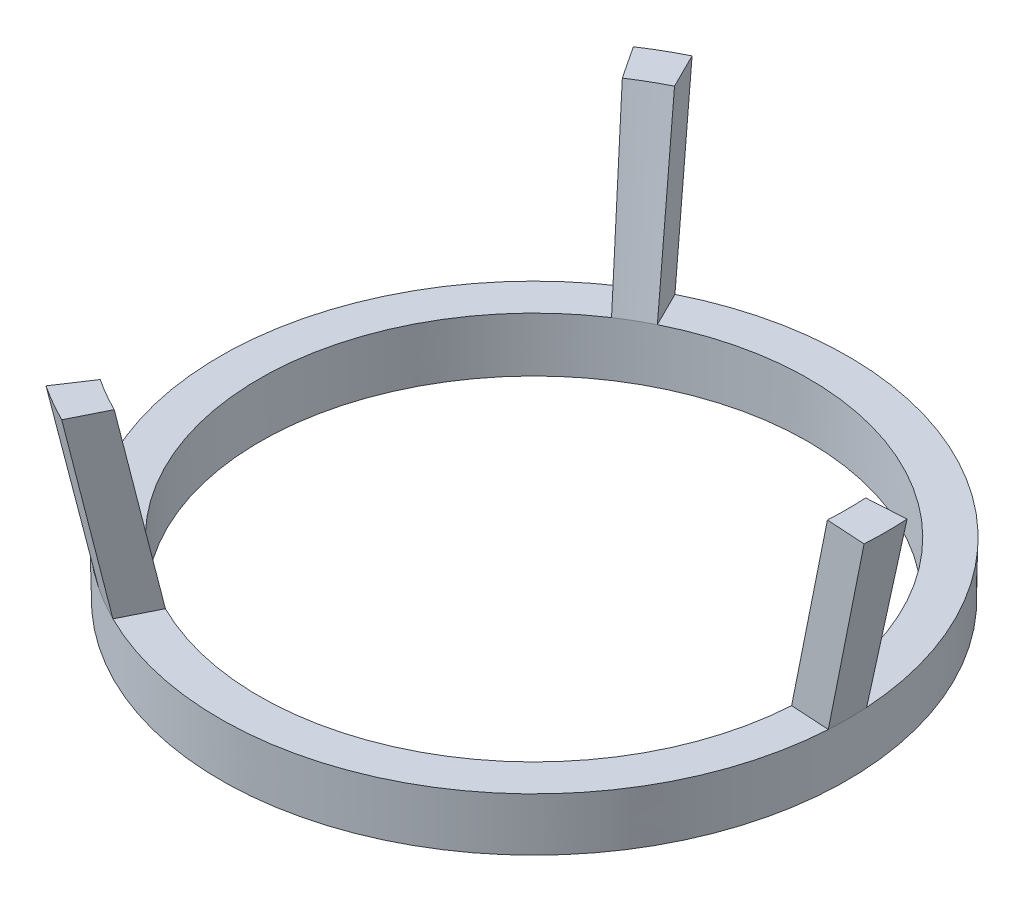
ISO-10303-21;
HEADER;
FILE_DESCRIPTION(('STEP AP214'),'2;1');
FILE_NAME('part.step','',(''),(''),'','','');
FILE_SCHEMA(('AUTOMOTIVE_DESIGN { 1 0 10303 214 1 1 1 1 }'));
ENDSEC;
DATA;
#1=APPLICATION_CONTEXT('core data for automotive mechanical design processes');
#2=APPLICATION_PROTOCOL_DEFINITION('international standard','automotive_design',2000,#1);
#3=PRODUCT_CONTEXT('',#1,'mechanical');
#4=PRODUCT('Part','Part','',(#3));
#5=PRODUCT_RELATED_PRODUCT_CATEGORY('part','',(#4));
#6=PRODUCT_DEFINITION_FORMATION('','',#4);
#7=PRODUCT_DEFINITION_CONTEXT('part definition',#1,'design');
#8=PRODUCT_DEFINITION('design','',#6,#7);
#9=PRODUCT_DEFINITION_SHAPE('','',#8);
#10=(LENGTH_UNIT() NAMED_UNIT(*) SI_UNIT(.MILLI.,.METRE.));
#11=(NAMED_UNIT(*) PLANE_ANGLE_UNIT() SI_UNIT($,.RADIAN.));
#12=(NAMED_UNIT(*) SI_UNIT($,.STERADIAN.) SOLID_ANGLE_UNIT());
#13=UNCERTAINTY_MEASURE_WITH_UNIT(LENGTH_MEASURE(1.E-05),#10,'distance_accuracy_value','');
#14=(GEOMETRIC_REPRESENTATION_CONTEXT(3) GLOBAL_UNCERTAINTY_ASSIGNED_CONTEXT((#13)) GLOBAL_UNIT_ASSIGNED_CONTEXT((#10,
#11,#12)) REPRESENTATION_CONTEXT('',''));
#15=CARTESIAN_POINT('',(0.,0.,0.));
#16=DIRECTION('',(0.,0.,1.));
#17=DIRECTION('',(1.,0.,0.));
#18=AXIS2_PLACEMENT_3D('',#15,#16,#17);
#19=CARTESIAN_POINT('',(14.0497844827586,2.75,0.));
#20=DIRECTION('',(0.,1.,0.));
#21=DIRECTION('',(0.,0.,1.));
#22=AXIS2_PLACEMENT_3D('',#19,#20,#21);
#23=PLANE('',#22);
#24=CARTESIAN_POINT('',(0.,2.75,0.));
#25=DIRECTION('',(0.,-1.,0.));
#26=DIRECTION('',(0.,0.,-1.));
#27=AXIS2_PLACEMENT_3D('',#24,#25,#26);
#28=CIRCLE('',#27,16.0497844827586);
#29=CARTESIAN_POINT('',(-7.16137873709051,2.75,-14.3635036299277));
#30=VERTEX_POINT('',#29);
#31=CARTESIAN_POINT('',(16.0198483994127,2.75,-0.979815902521624));
#32=VERTEX_POINT('',#31);
#33=EDGE_CURVE('E223',#30,#32,#28,.T.);
#34=ORIENTED_EDGE('',*,*,#33,.F.);
#35=DIRECTION('',(-0.4461978131098,0.,-0.894934361602029));
#36=VECTOR('',#35,1.);
#37=CARTESIAN_POINT('',(-7.16137873709051,2.75,-14.3635036299277));
#38=LINE('',#37,#36);
#39=CARTESIAN_POINT('',(-6.26898311087091,2.75,-12.5736349067237));
#40=VERTEX_POINT('',#39);
#41=EDGE_CURVE('E50',#40,#30,#38,.T.);
#42=ORIENTED_EDGE('',*,*,#41,.F.);
#43=CARTESIAN_POINT('',(0.,2.75,0.));
#44=DIRECTION('',(0.,-1.,0.));
#45=DIRECTION('',(0.,0.,-1.));
#46=AXIS2_PLACEMENT_3D('',#43,#44,#45);
#47=CIRCLE('',#46,14.0497844827586);
#48=CARTESIAN_POINT('',(14.023578802569,2.75,-0.85771882345191));
#49=VERTEX_POINT('',#48);
#50=EDGE_CURVE('E225',#40,#49,#47,.T.);
#51=ORIENTED_EDGE('',*,*,#50,.T.);
#52=DIRECTION('',(0.998134798421867,0.,-0.061048539534857));
#53=VECTOR('',#52,1.);
#54=CARTESIAN_POINT('',(16.0198483994127,2.75,-0.979815902521624));
#55=LINE('',#54,#53);
#56=EDGE_CURVE('E204',#49,#32,#55,.T.);
#57=ORIENTED_EDGE('',*,*,#56,.T.);
#58=EDGE_LOOP('',(#34,#42,#51,#57));
#59=FACE_BOUND('',#58,.T.);
#60=ADVANCED_FACE('F35',(#59),#23,.T.);
#61=DIRECTION('',(-0.551936985312051,0.,-0.833885822067173));
#62=VECTOR('',#61,1.);
#63=CARTESIAN_POINT('',(-8.85846966232192,2.75,-13.3836877274061));
#64=LINE('',#63,#62);
#65=CARTESIAN_POINT('',(-7.75459569169782,2.75,-11.7159160832718));
#66=VERTEX_POINT('',#65);
#67=CARTESIAN_POINT('',(-8.85846966232192,2.75,-13.3836877274061));
#68=VERTEX_POINT('',#67);
#69=EDGE_CURVE('E148',#66,#68,#64,.T.);
#70=ORIENTED_EDGE('',*,*,#69,.T.);
#71=CARTESIAN_POINT('',(-8.85846966232211,2.75,13.383687727406));
#72=VERTEX_POINT('',#71);
#73=EDGE_CURVE('E254',#72,#68,#28,.T.);
#74=ORIENTED_EDGE('',*,*,#73,.F.);
#75=DIRECTION('',(-0.551936985312062,0.,0.833885822067166));
#76=VECTOR('',#75,1.);
#77=CARTESIAN_POINT('',(-8.85846966232211,2.75,13.383687727406));
#78=LINE('',#77,#76);
#79=CARTESIAN_POINT('',(-7.75459569169799,2.75,11.7159160832717));
#80=VERTEX_POINT('',#79);
#81=EDGE_CURVE('E58',#80,#72,#78,.T.);
#82=ORIENTED_EDGE('',*,*,#81,.F.);
#83=EDGE_CURVE('E233',#80,#66,#47,.T.);
#84=ORIENTED_EDGE('',*,*,#83,.T.);
#85=EDGE_LOOP('',(#70,#74,#82,#84));
#86=FACE_BOUND('',#85,.T.);
#87=ADVANCED_FACE('F239',(#86),#23,.T.);
#88=DIRECTION('',(-0.446197813109813,0.,0.894934361602023));
#89=VECTOR('',#88,1.);
#90=CARTESIAN_POINT('',(-7.16137873709071,2.75,14.3635036299276));
#91=LINE('',#90,#89);
#92=CARTESIAN_POINT('',(-6.26898311087108,2.75,12.5736349067236));
#93=VERTEX_POINT('',#92);
#94=CARTESIAN_POINT('',(-7.16137873709071,2.75,14.3635036299276));
#95=VERTEX_POINT('',#94);
#96=EDGE_CURVE('E172',#93,#95,#91,.T.);
#97=ORIENTED_EDGE('',*,*,#96,.T.);
#98=CARTESIAN_POINT('',(16.0198483994127,2.75,0.979815902521624));
#99=VERTEX_POINT('',#98);
#100=EDGE_CURVE('E226',#99,#95,#28,.T.);
#101=ORIENTED_EDGE('',*,*,#100,.F.);
#102=DIRECTION('',(0.998134798421867,0.,0.061048539534857));
#103=VECTOR('',#102,1.);
#104=CARTESIAN_POINT('',(16.0198483994127,2.75,0.979815902521624));
#105=LINE('',#104,#103);
#106=CARTESIAN_POINT('',(14.023578802569,2.75,0.85771882345191));
#107=VERTEX_POINT('',#106);
#108=EDGE_CURVE('E192',#107,#99,#105,.T.);
#109=ORIENTED_EDGE('',*,*,#108,.F.);
#110=EDGE_CURVE('E228',#107,#93,#47,.T.);
#111=ORIENTED_EDGE('',*,*,#110,.T.);
#112=EDGE_LOOP('',(#97,#101,#109,#111));
#113=FACE_BOUND('',#112,.T.);
#114=ADVANCED_FACE('F269',(#113),#23,.T.);
#115=CARTESIAN_POINT('',(16.,0.,0.));
#116=DIRECTION('',(0.,-1.,0.));
#117=DIRECTION('',(0.,0.,-1.));
#118=AXIS2_PLACEMENT_3D('',#115,#116,#117);
#119=PLANE('',#118);
#120=CARTESIAN_POINT('',(0.,0.,0.));
#121=DIRECTION('',(0.,-1.,0.));
#122=DIRECTION('',(0.,0.,-1.));
#123=AXIS2_PLACEMENT_3D('',#120,#121,#122);
#124=CIRCLE('',#123,16.);
#125=CARTESIAN_POINT('',(0.,0.,-16.));
#126=VERTEX_POINT('',#125);
#127=EDGE_CURVE('E220',#126,#126,#124,.T.);
#128=ORIENTED_EDGE('',*,*,#127,.T.);
#129=EDGE_LOOP('',(#128));
#130=FACE_BOUND('',#129,.T.);
#131=CARTESIAN_POINT('',(0.,0.,0.));
#132=DIRECTION('',(0.,-1.,0.));
#133=DIRECTION('',(0.,0.,-1.));
#134=AXIS2_PLACEMENT_3D('',#131,#132,#133);
#135=CIRCLE('',#134,14.);
#136=CARTESIAN_POINT('',(0.,0.,-14.));
#137=VERTEX_POINT('',#136);
#138=EDGE_CURVE('E11',#137,#137,#135,.T.);
#139=ORIENTED_EDGE('',*,*,#138,.F.);
#140=EDGE_LOOP('',(#139));
#141=FACE_BOUND('',#140,.T.);
#142=ADVANCED_FACE('F37',(#130,#141),#119,.T.);
#143=CARTESIAN_POINT('',(0.,2.75,0.));
#144=DIRECTION('',(0.,1.,0.));
#145=DIRECTION('',(0.,0.,1.));
#146=AXIS2_PLACEMENT_3D('',#143,#144,#145);
#147=CONICAL_SURFACE('',#146,14.0497844827586,0.0181014709544314);
#148=ORIENTED_EDGE('',*,*,#138,.T.);
#149=EDGE_LOOP('',(#148));
#150=FACE_BOUND('',#149,.T.);
#151=EDGE_CURVE('E43',#49,#107,#47,.T.);
#152=ORIENTED_EDGE('',*,*,#151,.F.);
#153=ORIENTED_EDGE('',*,*,#50,.F.);
#154=CARTESIAN_POINT('',(0.,2.75,0.));
#155=DIRECTION('',(0.,-1.,0.));
#156=DIRECTION('',(-0.866025403784443,0.,0.499999999999992));
#157=AXIS2_PLACEMENT_3D('',#154,#155,#156);
#158=CIRCLE('',#157,14.0497844827586);
#159=EDGE_CURVE('E162',#66,#40,#158,.T.);
#160=ORIENTED_EDGE('',*,*,#159,.F.);
#161=ORIENTED_EDGE('',*,*,#83,.F.);
#162=CARTESIAN_POINT('',(0.,2.75,0.));
#163=DIRECTION('',(0.,-1.,0.));
#164=DIRECTION('',(0.866025403784436,0.,0.500000000000004));
#165=AXIS2_PLACEMENT_3D('',#162,#163,#164);
#166=CIRCLE('',#165,14.0497844827586);
#167=EDGE_CURVE('E190',#93,#80,#166,.T.);
#168=ORIENTED_EDGE('',*,*,#167,.F.);
#169=ORIENTED_EDGE('',*,*,#110,.F.);
#170=EDGE_LOOP('',(#152,#153,#160,#161,#168,#169));
#171=FACE_BOUND('',#170,.T.);
#172=ADVANCED_FACE('F246',(#150,#171),#147,.F.);
#173=CARTESIAN_POINT('',(0.,0.,0.));
#174=DIRECTION('',(0.,1.,0.));
#175=DIRECTION('',(0.,0.,1.));
#176=AXIS2_PLACEMENT_3D('',#173,#174,#175);
#177=CONICAL_SURFACE('',#176,16.,0.018101470954432);
#178=EDGE_CURVE('E224',#32,#99,#28,.T.);
#179=ORIENTED_EDGE('',*,*,#178,.T.);
#180=ORIENTED_EDGE('',*,*,#100,.T.);
#181=CARTESIAN_POINT('',(0.,2.75,0.));
#182=DIRECTION('',(0.,-1.,0.));
#183=DIRECTION('',(0.866025403784436,0.,0.500000000000004));
#184=AXIS2_PLACEMENT_3D('',#181,#182,#183);
#185=CIRCLE('',#184,16.0497844827586);
#186=EDGE_CURVE('E183',#95,#72,#185,.T.);
#187=ORIENTED_EDGE('',*,*,#186,.T.);
#188=ORIENTED_EDGE('',*,*,#73,.T.);
#189=CARTESIAN_POINT('',(0.,2.75,0.));
#190=DIRECTION('',(0.,-1.,0.));
#191=DIRECTION('',(-0.866025403784443,0.,0.499999999999992));
#192=AXIS2_PLACEMENT_3D('',#189,#190,#191);
#193=CIRCLE('',#192,16.0497844827586);
#194=EDGE_CURVE('E138',#68,#30,#193,.T.);
#195=ORIENTED_EDGE('',*,*,#194,.T.);
#196=ORIENTED_EDGE('',*,*,#33,.T.);
#197=EDGE_LOOP('',(#179,#180,#187,#188,#195,#196));
#198=FACE_BOUND('',#197,.T.);
#199=ORIENTED_EDGE('',*,*,#127,.F.);
#200=EDGE_LOOP('',(#199));
#201=FACE_BOUND('',#200,.T.);
#202=ADVANCED_FACE('F255',(#198,#201),#177,.T.);
#203=CARTESIAN_POINT('',(0.,12.,0.));
#204=DIRECTION('',(0.,1.,0.));
#205=DIRECTION('',(0.,0.,1.));
#206=AXIS2_PLACEMENT_3D('',#203,#204,#205);
#207=CONICAL_SURFACE('',#206,16.,0.2077909394396);
#208=CARTESIAN_POINT('',(0.,12.,0.));
#209=DIRECTION('',(0.,-1.,0.));
#210=DIRECTION('',(0.,0.,-1.));
#211=AXIS2_PLACEMENT_3D('',#208,#209,#210);
#212=CIRCLE('',#211,16.);
#213=CARTESIAN_POINT('',(15.9701567747499,12.,-0.976776632557712));
#214=VERTEX_POINT('',#213);
#215=CARTESIAN_POINT('',(15.9701567747499,12.,0.976776632557712));
#216=VERTEX_POINT('',#215);
#217=EDGE_CURVE('E218',#214,#216,#212,.T.);
#218=ORIENTED_EDGE('',*,*,#217,.F.);
#219=DIRECTION('',(-0.205914074480488,-0.978489028523481,0.0125942443210886));
#220=VECTOR('',#219,1.);
#221=CARTESIAN_POINT('',(14.023578802569,2.75,-0.85771882345191));
#222=LINE('',#221,#220);
#223=EDGE_CURVE('E213',#214,#49,#222,.T.);
#224=ORIENTED_EDGE('',*,*,#223,.T.);
#225=ORIENTED_EDGE('',*,*,#151,.T.);
#226=DIRECTION('',(-0.205914074480488,-0.978489028523481,-0.0125942443210886));
#227=VECTOR('',#226,1.);
#228=CARTESIAN_POINT('',(14.023578802569,2.75,0.85771882345191));
#229=LINE('',#228,#227);
#230=EDGE_CURVE('E201',#216,#107,#229,.T.);
#231=ORIENTED_EDGE('',*,*,#230,.F.);
#232=EDGE_LOOP('',(#218,#224,#225,#231));
#233=FACE_BOUND('',#232,.T.);
#234=ADVANCED_FACE('F299',(#233),#207,.F.);
#235=CARTESIAN_POINT('',(15.9701567747499,12.,-0.976776632557712));
#236=DIRECTION('',(0.,1.,0.));
#237=DIRECTION('',(0.,0.,1.));
#238=AXIS2_PLACEMENT_3D('',#235,#236,#237);
#239=PLANE('',#238);
#240=CARTESIAN_POINT('',(0.,12.,0.));
#241=DIRECTION('',(0.,-1.,0.));
#242=DIRECTION('',(0.,0.,-1.));
#243=AXIS2_PLACEMENT_3D('',#240,#241,#242);
#244=CIRCLE('',#243,18.);
#245=CARTESIAN_POINT('',(17.9664263715936,12.,-1.09887371162743));
#246=VERTEX_POINT('',#245);
#247=CARTESIAN_POINT('',(17.9664263715936,12.,1.09887371162743));
#248=VERTEX_POINT('',#247);
#249=EDGE_CURVE('E216',#246,#248,#244,.T.);
#250=ORIENTED_EDGE('',*,*,#249,.F.);
#251=DIRECTION('',(-0.998134798421867,0.,0.061048539534857));
#252=VECTOR('',#251,1.);
#253=CARTESIAN_POINT('',(15.9701567747499,12.,-0.976776632557712));
#254=LINE('',#253,#252);
#255=EDGE_CURVE('E210',#246,#214,#254,.T.);
#256=ORIENTED_EDGE('',*,*,#255,.T.);
#257=ORIENTED_EDGE('',*,*,#217,.T.);
#258=DIRECTION('',(-0.998134798421867,0.,-0.061048539534857));
#259=VECTOR('',#258,1.);
#260=CARTESIAN_POINT('',(15.9701567747499,12.,0.976776632557712));
#261=LINE('',#260,#259);
#262=EDGE_CURVE('E198',#248,#216,#261,.T.);
#263=ORIENTED_EDGE('',*,*,#262,.F.);
#264=EDGE_LOOP('',(#250,#256,#257,#263));
#265=FACE_BOUND('',#264,.T.);
#266=ADVANCED_FACE('F295',(#265),#239,.T.);
#267=CARTESIAN_POINT('',(0.,2.75,0.));
#268=DIRECTION('',(0.,1.,0.));
#269=DIRECTION('',(0.,0.,1.));
#270=AXIS2_PLACEMENT_3D('',#267,#268,#269);
#271=CONICAL_SURFACE('',#270,16.0497844827586,0.2077909394396);
#272=DIRECTION('',(0.205914074480488,0.978489028523481,-0.0125942443210886));
#273=VECTOR('',#272,1.);
#274=CARTESIAN_POINT('',(17.9664263715936,12.,-1.09887371162743));
#275=LINE('',#274,#273);
#276=EDGE_CURVE('E207',#32,#246,#275,.T.);
#277=ORIENTED_EDGE('',*,*,#276,.T.);
#278=ORIENTED_EDGE('',*,*,#249,.T.);
#279=DIRECTION('',(0.205914074480488,0.978489028523481,0.0125942443210886));
#280=VECTOR('',#279,1.);
#281=CARTESIAN_POINT('',(17.9664263715936,12.,1.09887371162743));
#282=LINE('',#281,#280);
#283=EDGE_CURVE('E195',#99,#248,#282,.T.);
#284=ORIENTED_EDGE('',*,*,#283,.F.);
#285=ORIENTED_EDGE('',*,*,#178,.F.);
#286=EDGE_LOOP('',(#277,#278,#284,#285));
#287=FACE_BOUND('',#286,.T.);
#288=ADVANCED_FACE('F289',(#287),#271,.T.);
#289=CARTESIAN_POINT('',(0.,0.,0.));
#290=DIRECTION('',(-0.061048539534857,0.,-0.998134798421867));
#291=DIRECTION('',(-0.998134798421867,0.,0.061048539534857));
#292=AXIS2_PLACEMENT_3D('',#289,#290,#291);
#293=PLANE('',#292);
#294=ORIENTED_EDGE('',*,*,#56,.F.);
#295=ORIENTED_EDGE('',*,*,#223,.F.);
#296=ORIENTED_EDGE('',*,*,#255,.F.);
#297=ORIENTED_EDGE('',*,*,#276,.F.);
#298=EDGE_LOOP('',(#294,#295,#296,#297));
#299=FACE_BOUND('',#298,.T.);
#300=ADVANCED_FACE('F292',(#299),#293,.T.);
#301=CARTESIAN_POINT('',(0.,0.,0.));
#302=DIRECTION('',(0.061048539534857,0.,-0.998134798421867));
#303=DIRECTION('',(-0.998134798421867,0.,-0.061048539534857));
#304=AXIS2_PLACEMENT_3D('',#301,#302,#303);
#305=PLANE('',#304);
#306=ORIENTED_EDGE('',*,*,#108,.T.);
#307=ORIENTED_EDGE('',*,*,#283,.T.);
#308=ORIENTED_EDGE('',*,*,#262,.T.);
#309=ORIENTED_EDGE('',*,*,#230,.T.);
#310=EDGE_LOOP('',(#306,#307,#308,#309));
#311=FACE_BOUND('',#310,.T.);
#312=ADVANCED_FACE('F298',(#311),#305,.F.);
#313=CARTESIAN_POINT('',(0.,12.,0.));
#314=DIRECTION('',(0.,1.,0.));
#315=DIRECTION('',(-0.866025403784436,0.,-0.500000000000004));
#316=AXIS2_PLACEMENT_3D('',#313,#314,#315);
#317=CONICAL_SURFACE('',#316,16.,0.2077909394396);
#318=CARTESIAN_POINT('',(0.,12.,0.));
#319=DIRECTION('',(0.,-1.,0.));
#320=DIRECTION('',(0.866025403784436,0.,0.500000000000004));
#321=AXIS2_PLACEMENT_3D('',#318,#319,#320);
#322=CIRCLE('',#321,16.);
#323=CARTESIAN_POINT('',(-7.13916500975701,12.,14.3189497856324));
#324=VERTEX_POINT('',#323);
#325=CARTESIAN_POINT('',(-8.830991764993,12.,13.3421731530747));
#326=VERTEX_POINT('',#325);
#327=EDGE_CURVE('E188',#324,#326,#322,.T.);
#328=ORIENTED_EDGE('',*,*,#327,.F.);
#329=DIRECTION('',(0.0920501017167141,-0.978489028523481,-0.184623941657407));
#330=VECTOR('',#329,1.);
#331=CARTESIAN_POINT('',(-6.26898311087108,2.75,12.5736349067236));
#332=LINE('',#331,#330);
#333=EDGE_CURVE('E181',#324,#93,#332,.T.);
#334=ORIENTED_EDGE('',*,*,#333,.T.);
#335=ORIENTED_EDGE('',*,*,#167,.T.);
#336=DIRECTION('',(0.113863972763775,-0.978489028523481,-0.172029697336319));
#337=VECTOR('',#336,1.);
#338=CARTESIAN_POINT('',(-7.75459569169799,2.75,11.7159160832717));
#339=LINE('',#338,#337);
#340=EDGE_CURVE('E170',#326,#80,#339,.T.);
#341=ORIENTED_EDGE('',*,*,#340,.F.);
#342=EDGE_LOOP('',(#328,#334,#335,#341));
#343=FACE_BOUND('',#342,.T.);
#344=ADVANCED_FACE('F314',(#343),#317,.F.);
#345=CARTESIAN_POINT('',(-7.13916500975701,12.,14.3189497856324));
#346=DIRECTION('',(0.,1.,0.));
#347=DIRECTION('',(-0.866025403784436,0.,-0.500000000000004));
#348=AXIS2_PLACEMENT_3D('',#345,#346,#347);
#349=PLANE('',#348);
#350=CARTESIAN_POINT('',(0.,12.,0.));
#351=DIRECTION('',(0.,-1.,0.));
#352=DIRECTION('',(0.866025403784436,0.,0.500000000000004));
#353=AXIS2_PLACEMENT_3D('',#350,#351,#352);
#354=CIRCLE('',#353,18.);
#355=CARTESIAN_POINT('',(-8.03156063597663,12.,16.1088185088364));
#356=VERTEX_POINT('',#355);
#357=CARTESIAN_POINT('',(-9.93486573561712,12.,15.009944797209));
#358=VERTEX_POINT('',#357);
#359=EDGE_CURVE('E186',#356,#358,#354,.T.);
#360=ORIENTED_EDGE('',*,*,#359,.F.);
#361=DIRECTION('',(0.446197813109813,0.,-0.894934361602023));
#362=VECTOR('',#361,1.);
#363=CARTESIAN_POINT('',(-7.13916500975701,12.,14.3189497856324));
#364=LINE('',#363,#362);
#365=EDGE_CURVE('E178',#356,#324,#364,.T.);
#366=ORIENTED_EDGE('',*,*,#365,.T.);
#367=ORIENTED_EDGE('',*,*,#327,.T.);
#368=DIRECTION('',(0.551936985312062,0.,-0.833885822067166));
#369=VECTOR('',#368,1.);
#370=CARTESIAN_POINT('',(-8.830991764993,12.,13.3421731530747));
#371=LINE('',#370,#369);
#372=EDGE_CURVE('E167',#358,#326,#371,.T.);
#373=ORIENTED_EDGE('',*,*,#372,.F.);
#374=EDGE_LOOP('',(#360,#366,#367,#373));
#375=FACE_BOUND('',#374,.T.);
#376=ADVANCED_FACE('F317',(#375),#349,.T.);
#377=CARTESIAN_POINT('',(0.,2.75,0.));
#378=DIRECTION('',(0.,1.,0.));
#379=DIRECTION('',(-0.866025403784436,0.,-0.500000000000004));
#380=AXIS2_PLACEMENT_3D('',#377,#378,#379);
#381=CONICAL_SURFACE('',#380,16.0497844827586,0.2077909394396);
#382=DIRECTION('',(-0.0920501017167142,0.978489028523481,0.184623941657407));
#383=VECTOR('',#382,1.);
#384=CARTESIAN_POINT('',(-8.03156063597663,12.,16.1088185088364));
#385=LINE('',#384,#383);
#386=EDGE_CURVE('E175',#95,#356,#385,.T.);
#387=ORIENTED_EDGE('',*,*,#386,.T.);
#388=ORIENTED_EDGE('',*,*,#359,.T.);
#389=DIRECTION('',(-0.113863972763775,0.978489028523481,0.172029697336319));
#390=VECTOR('',#389,1.);
#391=CARTESIAN_POINT('',(-9.93486573561712,12.,15.009944797209));
#392=LINE('',#391,#390);
#393=EDGE_CURVE('E165',#72,#358,#392,.T.);
#394=ORIENTED_EDGE('',*,*,#393,.F.);
#395=ORIENTED_EDGE('',*,*,#186,.F.);
#396=EDGE_LOOP('',(#387,#388,#394,#395));
#397=FACE_BOUND('',#396,.T.);
#398=ADVANCED_FACE('F321',(#397),#381,.T.);
#399=CARTESIAN_POINT('',(0.,0.,0.));
#400=DIRECTION('',(0.894934361602023,0.,0.446197813109813));
#401=DIRECTION('',(0.446197813109813,0.,-0.894934361602023));
#402=AXIS2_PLACEMENT_3D('',#399,#400,#401);
#403=PLANE('',#402);
#404=ORIENTED_EDGE('',*,*,#96,.F.);
#405=ORIENTED_EDGE('',*,*,#333,.F.);
#406=ORIENTED_EDGE('',*,*,#365,.F.);
#407=ORIENTED_EDGE('',*,*,#386,.F.);
#408=EDGE_LOOP('',(#404,#405,#406,#407));
#409=FACE_BOUND('',#408,.T.);
#410=ADVANCED_FACE('F325',(#409),#403,.T.);
#411=CARTESIAN_POINT('',(0.,0.,0.));
#412=DIRECTION('',(0.833885822067166,0.,0.551936985312062));
#413=DIRECTION('',(0.551936985312062,0.,-0.833885822067166));
#414=AXIS2_PLACEMENT_3D('',#411,#412,#413);
#415=PLANE('',#414);
#416=ORIENTED_EDGE('',*,*,#81,.T.);
#417=ORIENTED_EDGE('',*,*,#393,.T.);
#418=ORIENTED_EDGE('',*,*,#372,.T.);
#419=ORIENTED_EDGE('',*,*,#340,.T.);
#420=EDGE_LOOP('',(#416,#417,#418,#419));
#421=FACE_BOUND('',#420,.T.);
#422=ADVANCED_FACE('F329',(#421),#415,.F.);
#423=CARTESIAN_POINT('',(0.,12.,0.));
#424=DIRECTION('',(0.,1.,0.));
#425=DIRECTION('',(0.866025403784443,0.,-0.499999999999992));
#426=AXIS2_PLACEMENT_3D('',#423,#424,#425);
#427=CONICAL_SURFACE('',#426,16.,0.2077909394396);
#428=CARTESIAN_POINT('',(0.,12.,0.));
#429=DIRECTION('',(0.,-1.,0.));
#430=DIRECTION('',(-0.866025403784443,0.,0.499999999999992));
#431=AXIS2_PLACEMENT_3D('',#428,#429,#430);
#432=CIRCLE('',#431,16.);
#433=CARTESIAN_POINT('',(-8.83099176499281,12.,-13.3421731530748));
#434=VERTEX_POINT('',#433);
#435=CARTESIAN_POINT('',(-7.13916500975681,12.,-14.3189497856325));
#436=VERTEX_POINT('',#435);
#437=EDGE_CURVE('E137',#434,#436,#432,.T.);
#438=ORIENTED_EDGE('',*,*,#437,.F.);
#439=DIRECTION('',(0.113863972763773,-0.978489028523481,0.17202969733632));
#440=VECTOR('',#439,1.);
#441=CARTESIAN_POINT('',(-7.75459569169782,2.75,-11.7159160832718));
#442=LINE('',#441,#440);
#443=EDGE_CURVE('E157',#434,#66,#442,.T.);
#444=ORIENTED_EDGE('',*,*,#443,.T.);
#445=ORIENTED_EDGE('',*,*,#159,.T.);
#446=DIRECTION('',(0.0920501017167115,-0.978489028523481,0.184623941657409));
#447=VECTOR('',#446,1.);
#448=CARTESIAN_POINT('',(-6.26898311087091,2.75,-12.5736349067237));
#449=LINE('',#448,#447);
#450=EDGE_CURVE('E146',#436,#40,#449,.T.);
#451=ORIENTED_EDGE('',*,*,#450,.F.);
#452=EDGE_LOOP('',(#438,#444,#445,#451));
#453=FACE_BOUND('',#452,.T.);
#454=ADVANCED_FACE('F249',(#453),#427,.F.);
#455=CARTESIAN_POINT('',(-8.83099176499281,12.,-13.3421731530748));
#456=DIRECTION('',(0.,1.,0.));
#457=DIRECTION('',(0.866025403784443,0.,-0.499999999999992));
#458=AXIS2_PLACEMENT_3D('',#455,#456,#457);
#459=PLANE('',#458);
#460=CARTESIAN_POINT('',(0.,12.,0.));
#461=DIRECTION('',(0.,-1.,0.));
#462=DIRECTION('',(-0.866025403784443,0.,0.499999999999992));
#463=AXIS2_PLACEMENT_3D('',#460,#461,#462);
#464=CIRCLE('',#463,18.);
#465=CARTESIAN_POINT('',(-9.93486573561691,12.,-15.0099447972091));
#466=VERTEX_POINT('',#465);
#467=CARTESIAN_POINT('',(-8.03156063597641,12.,-16.1088185088365));
#468=VERTEX_POINT('',#467);
#469=EDGE_CURVE('E127',#466,#468,#464,.T.);
#470=ORIENTED_EDGE('',*,*,#469,.F.);
#471=DIRECTION('',(0.551936985312051,0.,0.833885822067173));
#472=VECTOR('',#471,1.);
#473=CARTESIAN_POINT('',(-8.83099176499281,12.,-13.3421731530748));
#474=LINE('',#473,#472);
#475=EDGE_CURVE('E155',#466,#434,#474,.T.);
#476=ORIENTED_EDGE('',*,*,#475,.T.);
#477=ORIENTED_EDGE('',*,*,#437,.T.);
#478=DIRECTION('',(0.4461978131098,0.,0.894934361602029));
#479=VECTOR('',#478,1.);
#480=CARTESIAN_POINT('',(-7.13916500975681,12.,-14.3189497856325));
#481=LINE('',#480,#479);
#482=EDGE_CURVE('E142',#468,#436,#481,.T.);
#483=ORIENTED_EDGE('',*,*,#482,.F.);
#484=EDGE_LOOP('',(#470,#476,#477,#483));
#485=FACE_BOUND('',#484,.T.);
#486=ADVANCED_FACE('F145',(#485),#459,.T.);
#487=CARTESIAN_POINT('',(0.,2.75,0.));
#488=DIRECTION('',(0.,1.,0.));
#489=DIRECTION('',(0.866025403784443,0.,-0.499999999999992));
#490=AXIS2_PLACEMENT_3D('',#487,#488,#489);
#491=CONICAL_SURFACE('',#490,16.0497844827586,0.2077909394396);
#492=DIRECTION('',(-0.113863972763773,0.978489028523481,-0.17202969733632));
#493=VECTOR('',#492,1.);
#494=CARTESIAN_POINT('',(-9.93486573561691,12.,-15.0099447972091));
#495=LINE('',#494,#493);
#496=EDGE_CURVE('E132',#68,#466,#495,.T.);
#497=ORIENTED_EDGE('',*,*,#496,.T.);
#498=ORIENTED_EDGE('',*,*,#469,.T.);
#499=DIRECTION('',(-0.0920501017167116,0.978489028523481,-0.184623941657409));
#500=VECTOR('',#499,1.);
#501=CARTESIAN_POINT('',(-8.03156063597641,12.,-16.1088185088365));
#502=LINE('',#501,#500);
#503=EDGE_CURVE('E129',#30,#468,#502,.T.);
#504=ORIENTED_EDGE('',*,*,#503,.F.);
#505=ORIENTED_EDGE('',*,*,#194,.F.);
#506=EDGE_LOOP('',(#497,#498,#504,#505));
#507=FACE_BOUND('',#506,.T.);
#508=ADVANCED_FACE('F128',(#507),#491,.T.);
#509=CARTESIAN_POINT('',(0.,0.,0.));
#510=DIRECTION('',(-0.833885822067173,0.,0.551936985312051));
#511=DIRECTION('',(0.551936985312051,0.,0.833885822067173));
#512=AXIS2_PLACEMENT_3D('',#509,#510,#511);
#513=PLANE('',#512);
#514=ORIENTED_EDGE('',*,*,#69,.F.);
#515=ORIENTED_EDGE('',*,*,#443,.F.);
#516=ORIENTED_EDGE('',*,*,#475,.F.);
#517=ORIENTED_EDGE('',*,*,#496,.F.);
#518=EDGE_LOOP('',(#514,#515,#516,#517));
#519=FACE_BOUND('',#518,.T.);
#520=ADVANCED_FACE('F258',(#519),#513,.T.);
#521=CARTESIAN_POINT('',(0.,0.,0.));
#522=DIRECTION('',(-0.894934361602029,0.,0.4461978131098));
#523=DIRECTION('',(0.4461978131098,0.,0.894934361602029));
#524=AXIS2_PLACEMENT_3D('',#521,#522,#523);
#525=PLANE('',#524);
#526=ORIENTED_EDGE('',*,*,#41,.T.);
#527=ORIENTED_EDGE('',*,*,#503,.T.);
#528=ORIENTED_EDGE('',*,*,#482,.T.);
#529=ORIENTED_EDGE('',*,*,#450,.T.);
#530=EDGE_LOOP('',(#526,#527,#528,#529));
#531=FACE_BOUND('',#530,.T.);
#532=ADVANCED_FACE('F141',(#531),#525,.F.);
#533=CLOSED_SHELL('',(#60,#87,#114,#142,#172,#202,#234,#266,#288,#300,#312,#344,#376,#398,#410,
#422,#454,#486,#508,#520,#532));
#534=MANIFOLD_SOLID_BREP('B2',#533);
#535=ADVANCED_BREP_SHAPE_REPRESENTATION('',(#18,#534),#14);
#536=SHAPE_DEFINITION_REPRESENTATION(#9,#535);
ENDSEC;
END-ISO-10303-21;
